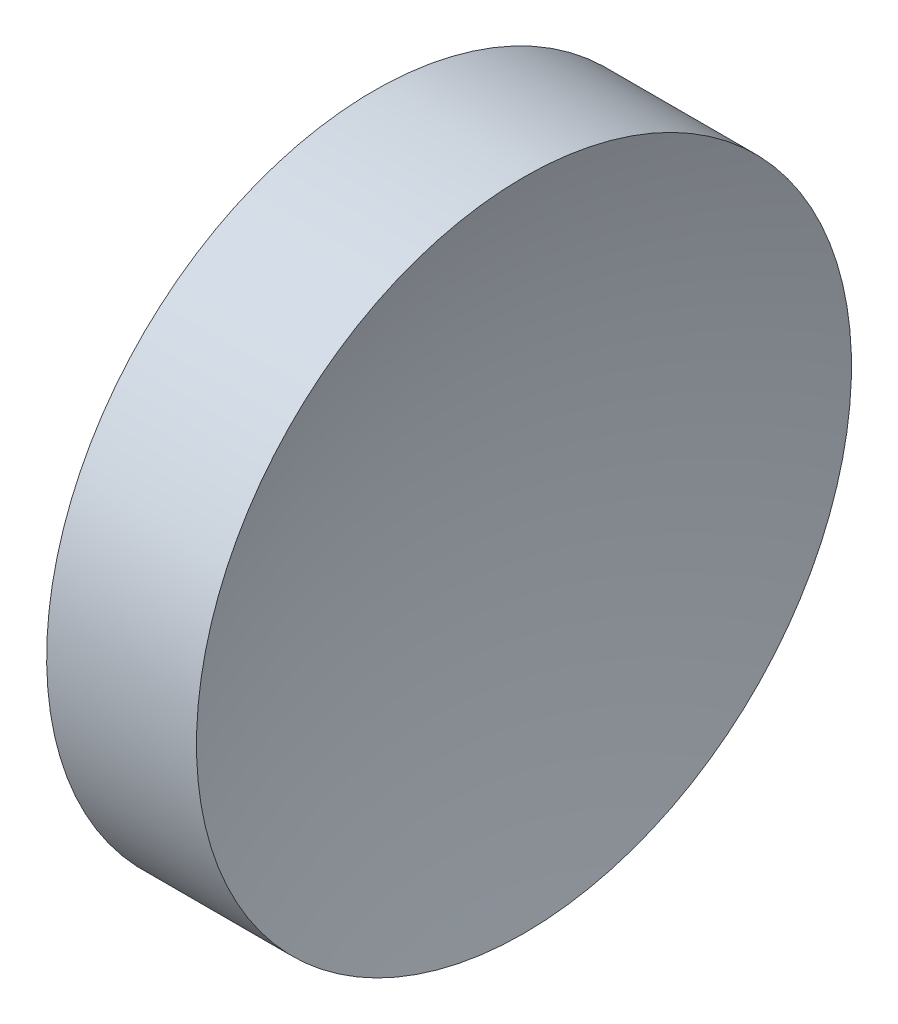
ISO-10303-21;
HEADER;
FILE_DESCRIPTION(('STEP AP214'),'2;1');
FILE_NAME('part.step','',(''),(''),'','','');
FILE_SCHEMA(('AUTOMOTIVE_DESIGN { 1 0 10303 214 1 1 1 1 }'));
ENDSEC;
DATA;
#1=APPLICATION_CONTEXT('core data for automotive mechanical design processes');
#2=APPLICATION_PROTOCOL_DEFINITION('international standard','automotive_design',2000,#1);
#3=PRODUCT_CONTEXT('',#1,'mechanical');
#4=PRODUCT('Part','Part','',(#3));
#5=PRODUCT_RELATED_PRODUCT_CATEGORY('part','',(#4));
#6=PRODUCT_DEFINITION_FORMATION('','',#4);
#7=PRODUCT_DEFINITION_CONTEXT('part definition',#1,'design');
#8=PRODUCT_DEFINITION('design','',#6,#7);
#9=PRODUCT_DEFINITION_SHAPE('','',#8);
#10=(LENGTH_UNIT() NAMED_UNIT(*) SI_UNIT(.MILLI.,.METRE.));
#11=(NAMED_UNIT(*) PLANE_ANGLE_UNIT() SI_UNIT($,.RADIAN.));
#12=(NAMED_UNIT(*) SI_UNIT($,.STERADIAN.) SOLID_ANGLE_UNIT());
#13=UNCERTAINTY_MEASURE_WITH_UNIT(LENGTH_MEASURE(1.E-05),#10,'distance_accuracy_value','');
#14=(GEOMETRIC_REPRESENTATION_CONTEXT(3) GLOBAL_UNCERTAINTY_ASSIGNED_CONTEXT((#13)) GLOBAL_UNIT_ASSIGNED_CONTEXT((#10,
#11,#12)) REPRESENTATION_CONTEXT('',''));
#15=CARTESIAN_POINT('',(0.,0.,0.));
#16=DIRECTION('',(0.,0.,1.));
#17=DIRECTION('',(1.,0.,0.));
#18=AXIS2_PLACEMENT_3D('',#15,#16,#17);
#19=CARTESIAN_POINT('',(40.1942320536207,13.031126091403,0.));
#20=DIRECTION('',(-1.,0.,0.));
#21=DIRECTION('',(0.,1.,0.));
#22=AXIS2_PLACEMENT_3D('',#19,#20,#21);
#23=SPHERICAL_SURFACE('',#22,16.27);
#24=CARTESIAN_POINT('',(24.7115675542523,13.031126091403,0.));
#25=DIRECTION('',(-1.,0.,0.));
#26=DIRECTION('',(0.,-1.,0.));
#27=AXIS2_PLACEMENT_3D('',#24,#25,#26);
#28=CIRCLE('',#27,5.);
#29=CARTESIAN_POINT('',(24.7115675542523,8.03112609140304,0.));
#30=VERTEX_POINT('',#29);
#31=EDGE_CURVE('E10',#30,#30,#28,.T.);
#32=ORIENTED_EDGE('',*,*,#31,.F.);
#33=EDGE_LOOP('',(#32));
#34=FACE_BOUND('',#33,.T.);
#35=ADVANCED_FACE('F35',(#34),#23,.F.);
#36=CARTESIAN_POINT('',(21.5059751180825,13.031126091403,0.));
#37=DIRECTION('',(-1.,0.,0.));
#38=DIRECTION('',(0.,-1.,0.));
#39=AXIS2_PLACEMENT_3D('',#36,#37,#38);
#40=CYLINDRICAL_SURFACE('',#39,5.);
#41=CARTESIAN_POINT('',(22.4242320536207,13.031126091403,0.));
#42=DIRECTION('',(-1.,0.,0.));
#43=DIRECTION('',(0.,-1.,0.));
#44=AXIS2_PLACEMENT_3D('',#41,#42,#43);
#45=CIRCLE('',#44,5.);
#46=CARTESIAN_POINT('',(22.4242320536207,8.03112609140304,0.));
#47=VERTEX_POINT('',#46);
#48=EDGE_CURVE('E41',#47,#47,#45,.T.);
#49=ORIENTED_EDGE('',*,*,#48,.F.);
#50=EDGE_LOOP('',(#49));
#51=FACE_BOUND('',#50,.T.);
#52=ORIENTED_EDGE('',*,*,#31,.T.);
#53=EDGE_LOOP('',(#52));
#54=FACE_BOUND('',#53,.T.);
#55=ADVANCED_FACE('F49',(#51,#54),#40,.T.);
#56=CARTESIAN_POINT('',(22.4242320536207,13.031126091403,0.));
#57=DIRECTION('',(1.,0.,0.));
#58=DIRECTION('',(0.,1.,0.));
#59=AXIS2_PLACEMENT_3D('',#56,#57,#58);
#60=PLANE('',#59);
#61=ORIENTED_EDGE('',*,*,#48,.T.);
#62=EDGE_LOOP('',(#61));
#63=FACE_BOUND('',#62,.T.);
#64=ADVANCED_FACE('F47',(#63),#60,.F.);
#65=CLOSED_SHELL('',(#35,#55,#64));
#66=MANIFOLD_SOLID_BREP('B2',#65);
#67=ADVANCED_BREP_SHAPE_REPRESENTATION('',(#18,#66),#14);
#68=SHAPE_DEFINITION_REPRESENTATION(#9,#67);
ENDSEC;
END-ISO-10303-21;
